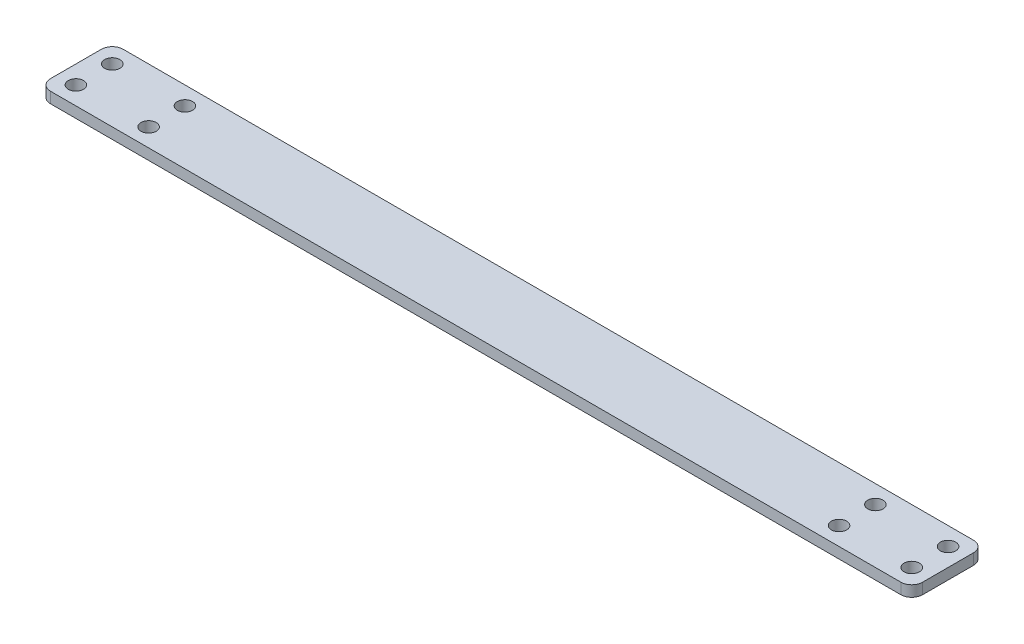
ISO-10303-21;
HEADER;
FILE_DESCRIPTION(('STEP AP214'),'2;1');
FILE_NAME('part.step','',(''),(''),'','','');
FILE_SCHEMA(('AUTOMOTIVE_DESIGN { 1 0 10303 214 1 1 1 1 }'));
ENDSEC;
DATA;
#1=APPLICATION_CONTEXT('core data for automotive mechanical design processes');
#2=APPLICATION_PROTOCOL_DEFINITION('international standard','automotive_design',2000,#1);
#3=PRODUCT_CONTEXT('',#1,'mechanical');
#4=PRODUCT('Part','Part','',(#3));
#5=PRODUCT_RELATED_PRODUCT_CATEGORY('part','',(#4));
#6=PRODUCT_DEFINITION_FORMATION('','',#4);
#7=PRODUCT_DEFINITION_CONTEXT('part definition',#1,'design');
#8=PRODUCT_DEFINITION('design','',#6,#7);
#9=PRODUCT_DEFINITION_SHAPE('','',#8);
#10=(LENGTH_UNIT() NAMED_UNIT(*) SI_UNIT(.MILLI.,.METRE.));
#11=(NAMED_UNIT(*) PLANE_ANGLE_UNIT() SI_UNIT($,.RADIAN.));
#12=(NAMED_UNIT(*) SI_UNIT($,.STERADIAN.) SOLID_ANGLE_UNIT());
#13=UNCERTAINTY_MEASURE_WITH_UNIT(LENGTH_MEASURE(1.E-05),#10,'distance_accuracy_value','');
#14=(GEOMETRIC_REPRESENTATION_CONTEXT(3) GLOBAL_UNCERTAINTY_ASSIGNED_CONTEXT((#13)) GLOBAL_UNIT_ASSIGNED_CONTEXT((#10,
#11,#12)) REPRESENTATION_CONTEXT('',''));
#15=CARTESIAN_POINT('',(0.,0.,0.));
#16=DIRECTION('',(0.,0.,1.));
#17=DIRECTION('',(1.,0.,0.));
#18=AXIS2_PLACEMENT_3D('',#15,#16,#17);
#19=CARTESIAN_POINT('',(0.,3.,0.));
#20=DIRECTION('',(0.,1.,0.));
#21=DIRECTION('',(0.,0.,1.));
#22=AXIS2_PLACEMENT_3D('',#19,#20,#21);
#23=PLANE('',#22);
#24=CARTESIAN_POINT('',(95.,3.,-5.00000000000001));
#25=DIRECTION('',(0.,1.,0.));
#26=DIRECTION('',(0.,0.,1.));
#27=AXIS2_PLACEMENT_3D('',#24,#25,#26);
#28=CIRCLE('',#27,2.10000000000002);
#29=CARTESIAN_POINT('',(95.,3.,-2.9));
#30=VERTEX_POINT('',#29);
#31=EDGE_CURVE('E215',#30,#30,#28,.T.);
#32=ORIENTED_EDGE('',*,*,#31,.F.);
#33=EDGE_LOOP('',(#32));
#34=FACE_BOUND('',#33,.T.);
#35=CARTESIAN_POINT('',(115.,3.,4.99999999999999));
#36=DIRECTION('',(0.,1.,0.));
#37=DIRECTION('',(0.,0.,1.));
#38=AXIS2_PLACEMENT_3D('',#35,#36,#37);
#39=CIRCLE('',#38,2.10000000000003);
#40=CARTESIAN_POINT('',(115.,3.,7.10000000000001));
#41=VERTEX_POINT('',#40);
#42=EDGE_CURVE('E203',#41,#41,#39,.T.);
#43=ORIENTED_EDGE('',*,*,#42,.F.);
#44=EDGE_LOOP('',(#43));
#45=FACE_BOUND('',#44,.T.);
#46=CARTESIAN_POINT('',(-95.,3.,4.99999999999999));
#47=DIRECTION('',(0.,1.,0.));
#48=DIRECTION('',(0.,0.,1.));
#49=AXIS2_PLACEMENT_3D('',#46,#47,#48);
#50=CIRCLE('',#49,2.10000000000004);
#51=CARTESIAN_POINT('',(-95.,3.,7.10000000000003));
#52=VERTEX_POINT('',#51);
#53=EDGE_CURVE('E191',#52,#52,#50,.T.);
#54=ORIENTED_EDGE('',*,*,#53,.F.);
#55=EDGE_LOOP('',(#54));
#56=FACE_BOUND('',#55,.T.);
#57=CARTESIAN_POINT('',(-115.,3.,-5.00000000000001));
#58=DIRECTION('',(0.,1.,0.));
#59=DIRECTION('',(0.,0.,1.));
#60=AXIS2_PLACEMENT_3D('',#57,#58,#59);
#61=CIRCLE('',#60,2.1);
#62=CARTESIAN_POINT('',(-115.,3.,-2.90000000000001));
#63=VERTEX_POINT('',#62);
#64=EDGE_CURVE('E133',#63,#63,#61,.T.);
#65=ORIENTED_EDGE('',*,*,#64,.F.);
#66=EDGE_LOOP('',(#65));
#67=FACE_BOUND('',#66,.T.);
#68=DIRECTION('',(1.,0.,0.));
#69=VECTOR('',#68,1.);
#70=CARTESIAN_POINT('',(-120.,3.,9.99999999999999));
#71=LINE('',#70,#69);
#72=CARTESIAN_POINT('',(-117.,3.,9.99999999999999));
#73=VERTEX_POINT('',#72);
#74=CARTESIAN_POINT('',(117.,3.,9.99999999999999));
#75=VERTEX_POINT('',#74);
#76=EDGE_CURVE('E142',#73,#75,#71,.T.);
#77=ORIENTED_EDGE('',*,*,#76,.T.);
#78=CARTESIAN_POINT('',(117.,3.,6.99999999999999));
#79=DIRECTION('',(0.,1.,0.));
#80=DIRECTION('',(0.,0.,1.));
#81=AXIS2_PLACEMENT_3D('',#78,#79,#80);
#82=CIRCLE('',#81,3.);
#83=CARTESIAN_POINT('',(120.,3.,6.99999999999999));
#84=VERTEX_POINT('',#83);
#85=EDGE_CURVE('E160',#75,#84,#82,.T.);
#86=ORIENTED_EDGE('',*,*,#85,.T.);
#87=DIRECTION('',(0.,0.,-1.));
#88=VECTOR('',#87,1.);
#89=CARTESIAN_POINT('',(120.,3.,-10.));
#90=LINE('',#89,#88);
#91=CARTESIAN_POINT('',(120.,3.,-7.00000000000001));
#92=VERTEX_POINT('',#91);
#93=EDGE_CURVE('E124',#84,#92,#90,.T.);
#94=ORIENTED_EDGE('',*,*,#93,.T.);
#95=CARTESIAN_POINT('',(117.,3.,-7.00000000000001));
#96=DIRECTION('',(0.,1.,0.));
#97=DIRECTION('',(0.,0.,1.));
#98=AXIS2_PLACEMENT_3D('',#95,#96,#97);
#99=CIRCLE('',#98,3.);
#100=CARTESIAN_POINT('',(117.,3.,-10.));
#101=VERTEX_POINT('',#100);
#102=EDGE_CURVE('E157',#92,#101,#99,.T.);
#103=ORIENTED_EDGE('',*,*,#102,.T.);
#104=DIRECTION('',(-1.,0.,0.));
#105=VECTOR('',#104,1.);
#106=CARTESIAN_POINT('',(-120.,3.,-10.));
#107=LINE('',#106,#105);
#108=CARTESIAN_POINT('',(-117.,3.,-10.));
#109=VERTEX_POINT('',#108);
#110=EDGE_CURVE('E171',#101,#109,#107,.T.);
#111=ORIENTED_EDGE('',*,*,#110,.T.);
#112=CARTESIAN_POINT('',(-117.,3.,-7.00000000000001));
#113=DIRECTION('',(0.,1.,0.));
#114=DIRECTION('',(0.,0.,1.));
#115=AXIS2_PLACEMENT_3D('',#112,#113,#114);
#116=CIRCLE('',#115,3.);
#117=CARTESIAN_POINT('',(-120.,3.,-7.00000000000001));
#118=VERTEX_POINT('',#117);
#119=EDGE_CURVE('E60',#109,#118,#116,.T.);
#120=ORIENTED_EDGE('',*,*,#119,.T.);
#121=DIRECTION('',(0.,0.,1.));
#122=VECTOR('',#121,1.);
#123=CARTESIAN_POINT('',(-120.,3.,-10.));
#124=LINE('',#123,#122);
#125=CARTESIAN_POINT('',(-120.,3.,6.99999999999999));
#126=VERTEX_POINT('',#125);
#127=EDGE_CURVE('E179',#118,#126,#124,.T.);
#128=ORIENTED_EDGE('',*,*,#127,.T.);
#129=CARTESIAN_POINT('',(-117.,3.,6.99999999999999));
#130=DIRECTION('',(0.,1.,0.));
#131=DIRECTION('',(0.,0.,1.));
#132=AXIS2_PLACEMENT_3D('',#129,#130,#131);
#133=CIRCLE('',#132,3.);
#134=EDGE_CURVE('E155',#126,#73,#133,.T.);
#135=ORIENTED_EDGE('',*,*,#134,.T.);
#136=EDGE_LOOP('',(#77,#86,#94,#103,#111,#120,#128,#135));
#137=FACE_BOUND('',#136,.T.);
#138=CARTESIAN_POINT('',(-95.,3.,-5.00000000000001));
#139=DIRECTION('',(0.,1.,0.));
#140=DIRECTION('',(0.,0.,-1.));
#141=AXIS2_PLACEMENT_3D('',#138,#139,#140);
#142=CIRCLE('',#141,2.10000000000002);
#143=CARTESIAN_POINT('',(-95.,3.,-7.10000000000003));
#144=VERTEX_POINT('',#143);
#145=EDGE_CURVE('E186',#144,#144,#142,.T.);
#146=ORIENTED_EDGE('',*,*,#145,.F.);
#147=EDGE_LOOP('',(#146));
#148=FACE_BOUND('',#147,.T.);
#149=CARTESIAN_POINT('',(-115.,3.,4.99999999999999));
#150=DIRECTION('',(0.,1.,0.));
#151=DIRECTION('',(0.,0.,-1.));
#152=AXIS2_PLACEMENT_3D('',#149,#150,#151);
#153=CIRCLE('',#152,2.10000000000003);
#154=CARTESIAN_POINT('',(-115.,3.,2.89999999999996));
#155=VERTEX_POINT('',#154);
#156=EDGE_CURVE('E197',#155,#155,#153,.T.);
#157=ORIENTED_EDGE('',*,*,#156,.F.);
#158=EDGE_LOOP('',(#157));
#159=FACE_BOUND('',#158,.T.);
#160=CARTESIAN_POINT('',(95.,3.,4.99999999999999));
#161=DIRECTION('',(0.,1.,0.));
#162=DIRECTION('',(0.,0.,-1.));
#163=AXIS2_PLACEMENT_3D('',#160,#161,#162);
#164=CIRCLE('',#163,2.10000000000004);
#165=CARTESIAN_POINT('',(95.,3.,2.89999999999995));
#166=VERTEX_POINT('',#165);
#167=EDGE_CURVE('E209',#166,#166,#164,.T.);
#168=ORIENTED_EDGE('',*,*,#167,.F.);
#169=EDGE_LOOP('',(#168));
#170=FACE_BOUND('',#169,.T.);
#171=CARTESIAN_POINT('',(115.,3.,-5.00000000000001));
#172=DIRECTION('',(0.,1.,0.));
#173=DIRECTION('',(0.,0.,-1.));
#174=AXIS2_PLACEMENT_3D('',#171,#172,#173);
#175=CIRCLE('',#174,2.1);
#176=CARTESIAN_POINT('',(115.,3.,-7.10000000000002));
#177=VERTEX_POINT('',#176);
#178=EDGE_CURVE('E221',#177,#177,#175,.T.);
#179=ORIENTED_EDGE('',*,*,#178,.F.);
#180=EDGE_LOOP('',(#179));
#181=FACE_BOUND('',#180,.T.);
#182=ADVANCED_FACE('F38',(#34,#45,#56,#67,#137,#148,#159,#170,#181),#23,.T.);
#183=CARTESIAN_POINT('',(0.,0.,0.));
#184=DIRECTION('',(0.,1.,0.));
#185=DIRECTION('',(0.,0.,1.));
#186=AXIS2_PLACEMENT_3D('',#183,#184,#185);
#187=PLANE('',#186);
#188=DIRECTION('',(0.,0.,-1.));
#189=VECTOR('',#188,1.);
#190=CARTESIAN_POINT('',(120.,0.,-10.));
#191=LINE('',#190,#189);
#192=CARTESIAN_POINT('',(120.,0.,6.99999999999999));
#193=VERTEX_POINT('',#192);
#194=CARTESIAN_POINT('',(120.,0.,-7.00000000000001));
#195=VERTEX_POINT('',#194);
#196=EDGE_CURVE('E121',#193,#195,#191,.T.);
#197=ORIENTED_EDGE('',*,*,#196,.F.);
#198=CARTESIAN_POINT('',(117.,0.,6.99999999999999));
#199=DIRECTION('',(0.,1.,0.));
#200=DIRECTION('',(0.,0.,1.));
#201=AXIS2_PLACEMENT_3D('',#198,#199,#200);
#202=CIRCLE('',#201,3.);
#203=CARTESIAN_POINT('',(117.,0.,9.99999999999999));
#204=VERTEX_POINT('',#203);
#205=EDGE_CURVE('E104',#193,#204,#202,.F.);
#206=ORIENTED_EDGE('',*,*,#205,.T.);
#207=DIRECTION('',(1.,0.,0.));
#208=VECTOR('',#207,1.);
#209=CARTESIAN_POINT('',(-120.,0.,9.99999999999999));
#210=LINE('',#209,#208);
#211=CARTESIAN_POINT('',(-117.,0.,9.99999999999999));
#212=VERTEX_POINT('',#211);
#213=EDGE_CURVE('E146',#212,#204,#210,.T.);
#214=ORIENTED_EDGE('',*,*,#213,.F.);
#215=CARTESIAN_POINT('',(-117.,0.,6.99999999999999));
#216=DIRECTION('',(0.,1.,0.));
#217=DIRECTION('',(0.,0.,1.));
#218=AXIS2_PLACEMENT_3D('',#215,#216,#217);
#219=CIRCLE('',#218,3.);
#220=CARTESIAN_POINT('',(-120.,0.,6.99999999999999));
#221=VERTEX_POINT('',#220);
#222=EDGE_CURVE('E125',#212,#221,#219,.F.);
#223=ORIENTED_EDGE('',*,*,#222,.T.);
#224=DIRECTION('',(0.,0.,1.));
#225=VECTOR('',#224,1.);
#226=CARTESIAN_POINT('',(-120.,0.,-10.));
#227=LINE('',#226,#225);
#228=CARTESIAN_POINT('',(-120.,0.,-7.00000000000001));
#229=VERTEX_POINT('',#228);
#230=EDGE_CURVE('E136',#229,#221,#227,.T.);
#231=ORIENTED_EDGE('',*,*,#230,.F.);
#232=CARTESIAN_POINT('',(-117.,0.,-7.00000000000001));
#233=DIRECTION('',(0.,1.,0.));
#234=DIRECTION('',(0.,0.,1.));
#235=AXIS2_PLACEMENT_3D('',#232,#233,#234);
#236=CIRCLE('',#235,3.);
#237=CARTESIAN_POINT('',(-117.,0.,-10.));
#238=VERTEX_POINT('',#237);
#239=EDGE_CURVE('E115',#229,#238,#236,.F.);
#240=ORIENTED_EDGE('',*,*,#239,.T.);
#241=DIRECTION('',(-1.,0.,0.));
#242=VECTOR('',#241,1.);
#243=CARTESIAN_POINT('',(-120.,0.,-10.));
#244=LINE('',#243,#242);
#245=CARTESIAN_POINT('',(117.,0.,-10.));
#246=VERTEX_POINT('',#245);
#247=EDGE_CURVE('E132',#246,#238,#244,.T.);
#248=ORIENTED_EDGE('',*,*,#247,.F.);
#249=CARTESIAN_POINT('',(117.,0.,-7.00000000000001));
#250=DIRECTION('',(0.,1.,0.));
#251=DIRECTION('',(0.,0.,1.));
#252=AXIS2_PLACEMENT_3D('',#249,#250,#251);
#253=CIRCLE('',#252,3.);
#254=EDGE_CURVE('E131',#246,#195,#253,.F.);
#255=ORIENTED_EDGE('',*,*,#254,.T.);
#256=EDGE_LOOP('',(#197,#206,#214,#223,#231,#240,#248,#255));
#257=FACE_BOUND('',#256,.T.);
#258=CARTESIAN_POINT('',(-115.,0.,-5.00000000000001));
#259=DIRECTION('',(0.,1.,0.));
#260=DIRECTION('',(0.,0.,1.));
#261=AXIS2_PLACEMENT_3D('',#258,#259,#260);
#262=CIRCLE('',#261,2.1);
#263=CARTESIAN_POINT('',(-115.,0.,-2.90000000000001));
#264=VERTEX_POINT('',#263);
#265=EDGE_CURVE('E139',#264,#264,#262,.T.);
#266=ORIENTED_EDGE('',*,*,#265,.T.);
#267=EDGE_LOOP('',(#266));
#268=FACE_BOUND('',#267,.T.);
#269=CARTESIAN_POINT('',(-95.,0.,-5.00000000000001));
#270=DIRECTION('',(0.,1.,0.));
#271=DIRECTION('',(0.,0.,-1.));
#272=AXIS2_PLACEMENT_3D('',#269,#270,#271);
#273=CIRCLE('',#272,2.10000000000002);
#274=CARTESIAN_POINT('',(-95.,0.,-7.10000000000003));
#275=VERTEX_POINT('',#274);
#276=EDGE_CURVE('E188',#275,#275,#273,.T.);
#277=ORIENTED_EDGE('',*,*,#276,.T.);
#278=EDGE_LOOP('',(#277));
#279=FACE_BOUND('',#278,.T.);
#280=CARTESIAN_POINT('',(-95.,0.,4.99999999999999));
#281=DIRECTION('',(0.,1.,0.));
#282=DIRECTION('',(0.,0.,1.));
#283=AXIS2_PLACEMENT_3D('',#280,#281,#282);
#284=CIRCLE('',#283,2.10000000000004);
#285=CARTESIAN_POINT('',(-95.,0.,7.10000000000003));
#286=VERTEX_POINT('',#285);
#287=EDGE_CURVE('E194',#286,#286,#284,.T.);
#288=ORIENTED_EDGE('',*,*,#287,.T.);
#289=EDGE_LOOP('',(#288));
#290=FACE_BOUND('',#289,.T.);
#291=CARTESIAN_POINT('',(-115.,0.,4.99999999999999));
#292=DIRECTION('',(0.,1.,0.));
#293=DIRECTION('',(0.,0.,-1.));
#294=AXIS2_PLACEMENT_3D('',#291,#292,#293);
#295=CIRCLE('',#294,2.10000000000003);
#296=CARTESIAN_POINT('',(-115.,0.,2.89999999999996));
#297=VERTEX_POINT('',#296);
#298=EDGE_CURVE('E200',#297,#297,#295,.T.);
#299=ORIENTED_EDGE('',*,*,#298,.T.);
#300=EDGE_LOOP('',(#299));
#301=FACE_BOUND('',#300,.T.);
#302=CARTESIAN_POINT('',(115.,0.,4.99999999999999));
#303=DIRECTION('',(0.,1.,0.));
#304=DIRECTION('',(0.,0.,1.));
#305=AXIS2_PLACEMENT_3D('',#302,#303,#304);
#306=CIRCLE('',#305,2.10000000000003);
#307=CARTESIAN_POINT('',(115.,0.,7.10000000000001));
#308=VERTEX_POINT('',#307);
#309=EDGE_CURVE('E206',#308,#308,#306,.T.);
#310=ORIENTED_EDGE('',*,*,#309,.T.);
#311=EDGE_LOOP('',(#310));
#312=FACE_BOUND('',#311,.T.);
#313=CARTESIAN_POINT('',(95.,0.,4.99999999999999));
#314=DIRECTION('',(0.,1.,0.));
#315=DIRECTION('',(0.,0.,-1.));
#316=AXIS2_PLACEMENT_3D('',#313,#314,#315);
#317=CIRCLE('',#316,2.10000000000004);
#318=CARTESIAN_POINT('',(95.,0.,2.89999999999995));
#319=VERTEX_POINT('',#318);
#320=EDGE_CURVE('E212',#319,#319,#317,.T.);
#321=ORIENTED_EDGE('',*,*,#320,.T.);
#322=EDGE_LOOP('',(#321));
#323=FACE_BOUND('',#322,.T.);
#324=CARTESIAN_POINT('',(95.,0.,-5.00000000000001));
#325=DIRECTION('',(0.,1.,0.));
#326=DIRECTION('',(0.,0.,1.));
#327=AXIS2_PLACEMENT_3D('',#324,#325,#326);
#328=CIRCLE('',#327,2.10000000000002);
#329=CARTESIAN_POINT('',(95.,0.,-2.9));
#330=VERTEX_POINT('',#329);
#331=EDGE_CURVE('E218',#330,#330,#328,.T.);
#332=ORIENTED_EDGE('',*,*,#331,.T.);
#333=EDGE_LOOP('',(#332));
#334=FACE_BOUND('',#333,.T.);
#335=CARTESIAN_POINT('',(115.,0.,-5.00000000000001));
#336=DIRECTION('',(0.,1.,0.));
#337=DIRECTION('',(0.,0.,-1.));
#338=AXIS2_PLACEMENT_3D('',#335,#336,#337);
#339=CIRCLE('',#338,2.1);
#340=CARTESIAN_POINT('',(115.,0.,-7.10000000000002));
#341=VERTEX_POINT('',#340);
#342=EDGE_CURVE('E224',#341,#341,#339,.T.);
#343=ORIENTED_EDGE('',*,*,#342,.T.);
#344=EDGE_LOOP('',(#343));
#345=FACE_BOUND('',#344,.T.);
#346=ADVANCED_FACE('F128',(#257,#268,#279,#290,#301,#312,#323,#334,#345),#187,.F.);
#347=CARTESIAN_POINT('',(120.,3.,-10.));
#348=DIRECTION('',(-1.,0.,0.));
#349=DIRECTION('',(0.,0.,1.));
#350=AXIS2_PLACEMENT_3D('',#347,#348,#349);
#351=PLANE('',#350);
#352=ORIENTED_EDGE('',*,*,#93,.F.);
#353=DIRECTION('',(0.,-1.,0.));
#354=VECTOR('',#353,1.);
#355=CARTESIAN_POINT('',(120.,3.,6.99999999999999));
#356=LINE('',#355,#354);
#357=EDGE_CURVE('E108',#84,#193,#356,.T.);
#358=ORIENTED_EDGE('',*,*,#357,.T.);
#359=ORIENTED_EDGE('',*,*,#196,.T.);
#360=DIRECTION('',(0.,-1.,0.));
#361=VECTOR('',#360,1.);
#362=CARTESIAN_POINT('',(120.,3.,-7.00000000000001));
#363=LINE('',#362,#361);
#364=EDGE_CURVE('E126',#195,#92,#363,.F.);
#365=ORIENTED_EDGE('',*,*,#364,.T.);
#366=EDGE_LOOP('',(#352,#358,#359,#365));
#367=FACE_BOUND('',#366,.T.);
#368=ADVANCED_FACE('F120',(#367),#351,.F.);
#369=CARTESIAN_POINT('',(-120.,3.,-10.));
#370=DIRECTION('',(0.,0.,1.));
#371=DIRECTION('',(1.,0.,0.));
#372=AXIS2_PLACEMENT_3D('',#369,#370,#371);
#373=PLANE('',#372);
#374=ORIENTED_EDGE('',*,*,#247,.T.);
#375=DIRECTION('',(0.,-1.,0.));
#376=VECTOR('',#375,1.);
#377=CARTESIAN_POINT('',(-117.,3.,-10.));
#378=LINE('',#377,#376);
#379=EDGE_CURVE('E11',#238,#109,#378,.F.);
#380=ORIENTED_EDGE('',*,*,#379,.T.);
#381=ORIENTED_EDGE('',*,*,#110,.F.);
#382=DIRECTION('',(0.,-1.,0.));
#383=VECTOR('',#382,1.);
#384=CARTESIAN_POINT('',(117.,3.,-10.));
#385=LINE('',#384,#383);
#386=EDGE_CURVE('E46',#101,#246,#385,.T.);
#387=ORIENTED_EDGE('',*,*,#386,.T.);
#388=EDGE_LOOP('',(#374,#380,#381,#387));
#389=FACE_BOUND('',#388,.T.);
#390=ADVANCED_FACE('F169',(#389),#373,.F.);
#391=CARTESIAN_POINT('',(-120.,3.,-10.));
#392=DIRECTION('',(1.,0.,0.));
#393=DIRECTION('',(0.,0.,-1.));
#394=AXIS2_PLACEMENT_3D('',#391,#392,#393);
#395=PLANE('',#394);
#396=ORIENTED_EDGE('',*,*,#127,.F.);
#397=DIRECTION('',(0.,-1.,0.));
#398=VECTOR('',#397,1.);
#399=CARTESIAN_POINT('',(-120.,3.,-7.00000000000001));
#400=LINE('',#399,#398);
#401=EDGE_CURVE('E163',#118,#229,#400,.T.);
#402=ORIENTED_EDGE('',*,*,#401,.T.);
#403=ORIENTED_EDGE('',*,*,#230,.T.);
#404=DIRECTION('',(0.,-1.,0.));
#405=VECTOR('',#404,1.);
#406=CARTESIAN_POINT('',(-120.,3.,6.99999999999999));
#407=LINE('',#406,#405);
#408=EDGE_CURVE('E53',#221,#126,#407,.F.);
#409=ORIENTED_EDGE('',*,*,#408,.T.);
#410=EDGE_LOOP('',(#396,#402,#403,#409));
#411=FACE_BOUND('',#410,.T.);
#412=ADVANCED_FACE('F178',(#411),#395,.F.);
#413=CARTESIAN_POINT('',(-120.,3.,9.99999999999999));
#414=DIRECTION('',(0.,0.,-1.));
#415=DIRECTION('',(-1.,0.,0.));
#416=AXIS2_PLACEMENT_3D('',#413,#414,#415);
#417=PLANE('',#416);
#418=ORIENTED_EDGE('',*,*,#213,.T.);
#419=DIRECTION('',(0.,-1.,0.));
#420=VECTOR('',#419,1.);
#421=CARTESIAN_POINT('',(117.,3.,9.99999999999999));
#422=LINE('',#421,#420);
#423=EDGE_CURVE('E109',#204,#75,#422,.F.);
#424=ORIENTED_EDGE('',*,*,#423,.T.);
#425=ORIENTED_EDGE('',*,*,#76,.F.);
#426=DIRECTION('',(0.,-1.,0.));
#427=VECTOR('',#426,1.);
#428=CARTESIAN_POINT('',(-117.,3.,9.99999999999999));
#429=LINE('',#428,#427);
#430=EDGE_CURVE('E114',#73,#212,#429,.T.);
#431=ORIENTED_EDGE('',*,*,#430,.T.);
#432=EDGE_LOOP('',(#418,#424,#425,#431));
#433=FACE_BOUND('',#432,.T.);
#434=ADVANCED_FACE('F246',(#433),#417,.F.);
#435=CARTESIAN_POINT('',(-115.,3.,-5.00000000000001));
#436=DIRECTION('',(0.,-1.,0.));
#437=DIRECTION('',(0.,0.,-1.));
#438=AXIS2_PLACEMENT_3D('',#435,#436,#437);
#439=CYLINDRICAL_SURFACE('',#438,2.1);
#440=ORIENTED_EDGE('',*,*,#64,.T.);
#441=EDGE_LOOP('',(#440));
#442=FACE_BOUND('',#441,.T.);
#443=ORIENTED_EDGE('',*,*,#265,.F.);
#444=EDGE_LOOP('',(#443));
#445=FACE_BOUND('',#444,.T.);
#446=ADVANCED_FACE('F243',(#442,#445),#439,.F.);
#447=CARTESIAN_POINT('',(-95.,3.,-5.00000000000001));
#448=DIRECTION('',(0.,-1.,0.));
#449=DIRECTION('',(0.,0.,-1.));
#450=AXIS2_PLACEMENT_3D('',#447,#448,#449);
#451=CYLINDRICAL_SURFACE('',#450,2.10000000000002);
#452=ORIENTED_EDGE('',*,*,#145,.T.);
#453=EDGE_LOOP('',(#452));
#454=FACE_BOUND('',#453,.T.);
#455=ORIENTED_EDGE('',*,*,#276,.F.);
#456=EDGE_LOOP('',(#455));
#457=FACE_BOUND('',#456,.T.);
#458=ADVANCED_FACE('F303',(#454,#457),#451,.F.);
#459=CARTESIAN_POINT('',(-95.,3.,4.99999999999999));
#460=DIRECTION('',(0.,-1.,0.));
#461=DIRECTION('',(0.,0.,-1.));
#462=AXIS2_PLACEMENT_3D('',#459,#460,#461);
#463=CYLINDRICAL_SURFACE('',#462,2.10000000000004);
#464=ORIENTED_EDGE('',*,*,#53,.T.);
#465=EDGE_LOOP('',(#464));
#466=FACE_BOUND('',#465,.T.);
#467=ORIENTED_EDGE('',*,*,#287,.F.);
#468=EDGE_LOOP('',(#467));
#469=FACE_BOUND('',#468,.T.);
#470=ADVANCED_FACE('F300',(#466,#469),#463,.F.);
#471=CARTESIAN_POINT('',(-115.,3.,4.99999999999999));
#472=DIRECTION('',(0.,-1.,0.));
#473=DIRECTION('',(0.,0.,-1.));
#474=AXIS2_PLACEMENT_3D('',#471,#472,#473);
#475=CYLINDRICAL_SURFACE('',#474,2.10000000000003);
#476=ORIENTED_EDGE('',*,*,#156,.T.);
#477=EDGE_LOOP('',(#476));
#478=FACE_BOUND('',#477,.T.);
#479=ORIENTED_EDGE('',*,*,#298,.F.);
#480=EDGE_LOOP('',(#479));
#481=FACE_BOUND('',#480,.T.);
#482=ADVANCED_FACE('F296',(#478,#481),#475,.F.);
#483=CARTESIAN_POINT('',(115.,3.,4.99999999999999));
#484=DIRECTION('',(0.,-1.,0.));
#485=DIRECTION('',(0.,0.,-1.));
#486=AXIS2_PLACEMENT_3D('',#483,#484,#485);
#487=CYLINDRICAL_SURFACE('',#486,2.10000000000003);
#488=ORIENTED_EDGE('',*,*,#42,.T.);
#489=EDGE_LOOP('',(#488));
#490=FACE_BOUND('',#489,.T.);
#491=ORIENTED_EDGE('',*,*,#309,.F.);
#492=EDGE_LOOP('',(#491));
#493=FACE_BOUND('',#492,.T.);
#494=ADVANCED_FACE('F278',(#490,#493),#487,.F.);
#495=CARTESIAN_POINT('',(95.,3.,4.99999999999999));
#496=DIRECTION('',(0.,-1.,0.));
#497=DIRECTION('',(0.,0.,-1.));
#498=AXIS2_PLACEMENT_3D('',#495,#496,#497);
#499=CYLINDRICAL_SURFACE('',#498,2.10000000000004);
#500=ORIENTED_EDGE('',*,*,#167,.T.);
#501=EDGE_LOOP('',(#500));
#502=FACE_BOUND('',#501,.T.);
#503=ORIENTED_EDGE('',*,*,#320,.F.);
#504=EDGE_LOOP('',(#503));
#505=FACE_BOUND('',#504,.T.);
#506=ADVANCED_FACE('F274',(#502,#505),#499,.F.);
#507=CARTESIAN_POINT('',(95.,3.,-5.00000000000001));
#508=DIRECTION('',(0.,-1.,0.));
#509=DIRECTION('',(0.,0.,-1.));
#510=AXIS2_PLACEMENT_3D('',#507,#508,#509);
#511=CYLINDRICAL_SURFACE('',#510,2.10000000000002);
#512=ORIENTED_EDGE('',*,*,#31,.T.);
#513=EDGE_LOOP('',(#512));
#514=FACE_BOUND('',#513,.T.);
#515=ORIENTED_EDGE('',*,*,#331,.F.);
#516=EDGE_LOOP('',(#515));
#517=FACE_BOUND('',#516,.T.);
#518=ADVANCED_FACE('F277',(#514,#517),#511,.F.);
#519=CARTESIAN_POINT('',(115.,3.,-5.00000000000001));
#520=DIRECTION('',(0.,-1.,0.));
#521=DIRECTION('',(0.,0.,-1.));
#522=AXIS2_PLACEMENT_3D('',#519,#520,#521);
#523=CYLINDRICAL_SURFACE('',#522,2.1);
#524=ORIENTED_EDGE('',*,*,#178,.T.);
#525=EDGE_LOOP('',(#524));
#526=FACE_BOUND('',#525,.T.);
#527=ORIENTED_EDGE('',*,*,#342,.F.);
#528=EDGE_LOOP('',(#527));
#529=FACE_BOUND('',#528,.T.);
#530=ADVANCED_FACE('F230',(#526,#529),#523,.F.);
#531=CARTESIAN_POINT('',(117.,3.,6.99999999999999));
#532=DIRECTION('',(0.,-1.,0.));
#533=DIRECTION('',(0.,0.,-1.));
#534=AXIS2_PLACEMENT_3D('',#531,#532,#533);
#535=CYLINDRICAL_SURFACE('',#534,3.);
#536=ORIENTED_EDGE('',*,*,#85,.F.);
#537=ORIENTED_EDGE('',*,*,#423,.F.);
#538=ORIENTED_EDGE('',*,*,#205,.F.);
#539=ORIENTED_EDGE('',*,*,#357,.F.);
#540=EDGE_LOOP('',(#536,#537,#538,#539));
#541=FACE_BOUND('',#540,.T.);
#542=ADVANCED_FACE('F107',(#541),#535,.T.);
#543=CARTESIAN_POINT('',(-117.,3.,-7.00000000000001));
#544=DIRECTION('',(0.,-1.,0.));
#545=DIRECTION('',(0.,0.,-1.));
#546=AXIS2_PLACEMENT_3D('',#543,#544,#545);
#547=CYLINDRICAL_SURFACE('',#546,3.);
#548=ORIENTED_EDGE('',*,*,#119,.F.);
#549=ORIENTED_EDGE('',*,*,#379,.F.);
#550=ORIENTED_EDGE('',*,*,#239,.F.);
#551=ORIENTED_EDGE('',*,*,#401,.F.);
#552=EDGE_LOOP('',(#548,#549,#550,#551));
#553=FACE_BOUND('',#552,.T.);
#554=ADVANCED_FACE('F177',(#553),#547,.T.);
#555=CARTESIAN_POINT('',(117.,3.,-7.00000000000001));
#556=DIRECTION('',(0.,-1.,0.));
#557=DIRECTION('',(0.,0.,-1.));
#558=AXIS2_PLACEMENT_3D('',#555,#556,#557);
#559=CYLINDRICAL_SURFACE('',#558,3.);
#560=ORIENTED_EDGE('',*,*,#102,.F.);
#561=ORIENTED_EDGE('',*,*,#364,.F.);
#562=ORIENTED_EDGE('',*,*,#254,.F.);
#563=ORIENTED_EDGE('',*,*,#386,.F.);
#564=EDGE_LOOP('',(#560,#561,#562,#563));
#565=FACE_BOUND('',#564,.T.);
#566=ADVANCED_FACE('F259',(#565),#559,.T.);
#567=CARTESIAN_POINT('',(-117.,3.,6.99999999999999));
#568=DIRECTION('',(0.,-1.,0.));
#569=DIRECTION('',(0.,0.,-1.));
#570=AXIS2_PLACEMENT_3D('',#567,#568,#569);
#571=CYLINDRICAL_SURFACE('',#570,3.);
#572=ORIENTED_EDGE('',*,*,#134,.F.);
#573=ORIENTED_EDGE('',*,*,#408,.F.);
#574=ORIENTED_EDGE('',*,*,#222,.F.);
#575=ORIENTED_EDGE('',*,*,#430,.F.);
#576=EDGE_LOOP('',(#572,#573,#574,#575));
#577=FACE_BOUND('',#576,.T.);
#578=ADVANCED_FACE('F40',(#577),#571,.T.);
#579=CLOSED_SHELL('',(#182,#346,#368,#390,#412,#434,#446,#458,#470,#482,#494,#506,#518,#530,
#542,#554,#566,#578));
#580=MANIFOLD_SOLID_BREP('B2',#579);
#581=ADVANCED_BREP_SHAPE_REPRESENTATION('',(#18,#580),#14);
#582=SHAPE_DEFINITION_REPRESENTATION(#9,#581);
ENDSEC;
END-ISO-10303-21;
